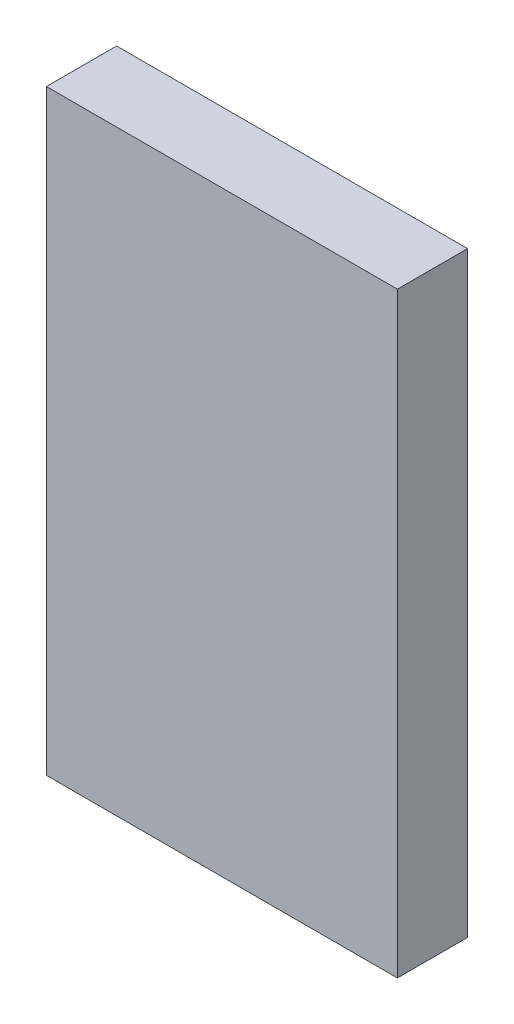
ISO-10303-21;
HEADER;
FILE_DESCRIPTION(('STEP AP214'),'2;1');
FILE_NAME('part.step','',(''),(''),'','','');
FILE_SCHEMA(('AUTOMOTIVE_DESIGN { 1 0 10303 214 1 1 1 1 }'));
ENDSEC;
DATA;
#1=APPLICATION_CONTEXT('core data for automotive mechanical design processes');
#2=APPLICATION_PROTOCOL_DEFINITION('international standard','automotive_design',2000,#1);
#3=PRODUCT_CONTEXT('',#1,'mechanical');
#4=PRODUCT('Part','Part','',(#3));
#5=PRODUCT_RELATED_PRODUCT_CATEGORY('part','',(#4));
#6=PRODUCT_DEFINITION_FORMATION('','',#4);
#7=PRODUCT_DEFINITION_CONTEXT('part definition',#1,'design');
#8=PRODUCT_DEFINITION('design','',#6,#7);
#9=PRODUCT_DEFINITION_SHAPE('','',#8);
#10=(LENGTH_UNIT() NAMED_UNIT(*) SI_UNIT(.MILLI.,.METRE.));
#11=(NAMED_UNIT(*) PLANE_ANGLE_UNIT() SI_UNIT($,.RADIAN.));
#12=(NAMED_UNIT(*) SI_UNIT($,.STERADIAN.) SOLID_ANGLE_UNIT());
#13=UNCERTAINTY_MEASURE_WITH_UNIT(LENGTH_MEASURE(1.E-05),#10,'distance_accuracy_value','');
#14=(GEOMETRIC_REPRESENTATION_CONTEXT(3) GLOBAL_UNCERTAINTY_ASSIGNED_CONTEXT((#13)) GLOBAL_UNIT_ASSIGNED_CONTEXT((#10,
#11,#12)) REPRESENTATION_CONTEXT('',''));
#15=CARTESIAN_POINT('',(0.,0.,0.));
#16=DIRECTION('',(0.,0.,1.));
#17=DIRECTION('',(1.,0.,0.));
#18=AXIS2_PLACEMENT_3D('',#15,#16,#17);
#19=CARTESIAN_POINT('',(20.,0.,4.));
#20=DIRECTION('',(0.,1.,0.));
#21=DIRECTION('',(-1.,0.,0.));
#22=AXIS2_PLACEMENT_3D('',#19,#20,#21);
#23=PLANE('',#22);
#24=DIRECTION('',(1.,0.,0.));
#25=VECTOR('',#24,1.);
#26=CARTESIAN_POINT('',(20.,0.,0.));
#27=LINE('',#26,#25);
#28=CARTESIAN_POINT('',(0.,0.,0.));
#29=VERTEX_POINT('',#28);
#30=CARTESIAN_POINT('',(20.,0.,0.));
#31=VERTEX_POINT('',#30);
#32=EDGE_CURVE('E95',#29,#31,#27,.T.);
#33=ORIENTED_EDGE('',*,*,#32,.T.);
#34=DIRECTION('',(0.,0.,-1.));
#35=VECTOR('',#34,1.);
#36=CARTESIAN_POINT('',(20.,0.,4.));
#37=LINE('',#36,#35);
#38=CARTESIAN_POINT('',(20.,0.,4.));
#39=VERTEX_POINT('',#38);
#40=EDGE_CURVE('E11',#39,#31,#37,.T.);
#41=ORIENTED_EDGE('',*,*,#40,.F.);
#42=DIRECTION('',(1.,0.,0.));
#43=VECTOR('',#42,1.);
#44=CARTESIAN_POINT('',(20.,0.,4.));
#45=LINE('',#44,#43);
#46=CARTESIAN_POINT('',(0.,0.,4.));
#47=VERTEX_POINT('',#46);
#48=EDGE_CURVE('E83',#47,#39,#45,.T.);
#49=ORIENTED_EDGE('',*,*,#48,.F.);
#50=DIRECTION('',(0.,0.,-1.));
#51=VECTOR('',#50,1.);
#52=CARTESIAN_POINT('',(0.,0.,4.));
#53=LINE('',#52,#51);
#54=EDGE_CURVE('E91',#47,#29,#53,.T.);
#55=ORIENTED_EDGE('',*,*,#54,.T.);
#56=EDGE_LOOP('',(#33,#41,#49,#55));
#57=FACE_BOUND('',#56,.T.);
#58=ADVANCED_FACE('F32',(#57),#23,.F.);
#59=CARTESIAN_POINT('',(20.,34.,4.));
#60=DIRECTION('',(-1.,0.,0.));
#61=DIRECTION('',(0.,-1.,0.));
#62=AXIS2_PLACEMENT_3D('',#59,#60,#61);
#63=PLANE('',#62);
#64=DIRECTION('',(0.,1.,0.));
#65=VECTOR('',#64,1.);
#66=CARTESIAN_POINT('',(20.,34.,0.));
#67=LINE('',#66,#65);
#68=CARTESIAN_POINT('',(20.,34.,0.));
#69=VERTEX_POINT('',#68);
#70=EDGE_CURVE('E87',#31,#69,#67,.T.);
#71=ORIENTED_EDGE('',*,*,#70,.T.);
#72=DIRECTION('',(0.,0.,-1.));
#73=VECTOR('',#72,1.);
#74=CARTESIAN_POINT('',(20.,34.,4.));
#75=LINE('',#74,#73);
#76=CARTESIAN_POINT('',(20.,34.,4.));
#77=VERTEX_POINT('',#76);
#78=EDGE_CURVE('E40',#77,#69,#75,.T.);
#79=ORIENTED_EDGE('',*,*,#78,.F.);
#80=DIRECTION('',(0.,1.,0.));
#81=VECTOR('',#80,1.);
#82=CARTESIAN_POINT('',(20.,34.,4.));
#83=LINE('',#82,#81);
#84=EDGE_CURVE('E78',#39,#77,#83,.T.);
#85=ORIENTED_EDGE('',*,*,#84,.F.);
#86=ORIENTED_EDGE('',*,*,#40,.T.);
#87=EDGE_LOOP('',(#71,#79,#85,#86));
#88=FACE_BOUND('',#87,.T.);
#89=ADVANCED_FACE('F86',(#88),#63,.F.);
#90=CARTESIAN_POINT('',(0.,34.,4.));
#91=DIRECTION('',(0.,-1.,0.));
#92=DIRECTION('',(0.,0.,-1.));
#93=AXIS2_PLACEMENT_3D('',#90,#91,#92);
#94=PLANE('',#93);
#95=DIRECTION('',(-1.,0.,0.));
#96=VECTOR('',#95,1.);
#97=CARTESIAN_POINT('',(0.,34.,0.));
#98=LINE('',#97,#96);
#99=CARTESIAN_POINT('',(0.,34.,0.));
#100=VERTEX_POINT('',#99);
#101=EDGE_CURVE('E65',#69,#100,#98,.T.);
#102=ORIENTED_EDGE('',*,*,#101,.T.);
#103=DIRECTION('',(0.,0.,-1.));
#104=VECTOR('',#103,1.);
#105=CARTESIAN_POINT('',(0.,34.,4.));
#106=LINE('',#105,#104);
#107=CARTESIAN_POINT('',(0.,34.,4.));
#108=VERTEX_POINT('',#107);
#109=EDGE_CURVE('E88',#108,#100,#106,.T.);
#110=ORIENTED_EDGE('',*,*,#109,.F.);
#111=DIRECTION('',(-1.,0.,0.));
#112=VECTOR('',#111,1.);
#113=CARTESIAN_POINT('',(0.,34.,4.));
#114=LINE('',#113,#112);
#115=EDGE_CURVE('E81',#77,#108,#114,.T.);
#116=ORIENTED_EDGE('',*,*,#115,.F.);
#117=ORIENTED_EDGE('',*,*,#78,.T.);
#118=EDGE_LOOP('',(#102,#110,#116,#117));
#119=FACE_BOUND('',#118,.T.);
#120=ADVANCED_FACE('F89',(#119),#94,.F.);
#121=CARTESIAN_POINT('',(0.,0.,4.));
#122=DIRECTION('',(1.,0.,0.));
#123=DIRECTION('',(0.,0.,-1.));
#124=AXIS2_PLACEMENT_3D('',#121,#122,#123);
#125=PLANE('',#124);
#126=DIRECTION('',(0.,-1.,0.));
#127=VECTOR('',#126,1.);
#128=CARTESIAN_POINT('',(0.,0.,0.));
#129=LINE('',#128,#127);
#130=EDGE_CURVE('E71',#100,#29,#129,.T.);
#131=ORIENTED_EDGE('',*,*,#130,.T.);
#132=ORIENTED_EDGE('',*,*,#54,.F.);
#133=DIRECTION('',(0.,-1.,0.));
#134=VECTOR('',#133,1.);
#135=CARTESIAN_POINT('',(0.,0.,4.));
#136=LINE('',#135,#134);
#137=EDGE_CURVE('E48',#108,#47,#136,.T.);
#138=ORIENTED_EDGE('',*,*,#137,.F.);
#139=ORIENTED_EDGE('',*,*,#109,.T.);
#140=EDGE_LOOP('',(#131,#132,#138,#139));
#141=FACE_BOUND('',#140,.T.);
#142=ADVANCED_FACE('F102',(#141),#125,.F.);
#143=CARTESIAN_POINT('',(0.,0.,4.));
#144=DIRECTION('',(0.,0.,-1.));
#145=DIRECTION('',(-1.,0.,0.));
#146=AXIS2_PLACEMENT_3D('',#143,#144,#145);
#147=PLANE('',#146);
#148=ORIENTED_EDGE('',*,*,#48,.T.);
#149=ORIENTED_EDGE('',*,*,#84,.T.);
#150=ORIENTED_EDGE('',*,*,#115,.T.);
#151=ORIENTED_EDGE('',*,*,#137,.T.);
#152=EDGE_LOOP('',(#148,#149,#150,#151));
#153=FACE_BOUND('',#152,.T.);
#154=ADVANCED_FACE('F79',(#153),#147,.F.);
#155=CARTESIAN_POINT('',(0.,0.,0.));
#156=DIRECTION('',(0.,0.,-1.));
#157=DIRECTION('',(-1.,0.,0.));
#158=AXIS2_PLACEMENT_3D('',#155,#156,#157);
#159=PLANE('',#158);
#160=ORIENTED_EDGE('',*,*,#32,.F.);
#161=ORIENTED_EDGE('',*,*,#130,.F.);
#162=ORIENTED_EDGE('',*,*,#101,.F.);
#163=ORIENTED_EDGE('',*,*,#70,.F.);
#164=EDGE_LOOP('',(#160,#161,#162,#163));
#165=FACE_BOUND('',#164,.T.);
#166=ADVANCED_FACE('F105',(#165),#159,.T.);
#167=CLOSED_SHELL('',(#58,#89,#120,#142,#154,#166));
#168=MANIFOLD_SOLID_BREP('B2',#167);
#169=ADVANCED_BREP_SHAPE_REPRESENTATION('',(#18,#168),#14);
#170=SHAPE_DEFINITION_REPRESENTATION(#9,#169);
ENDSEC;
END-ISO-10303-21;
